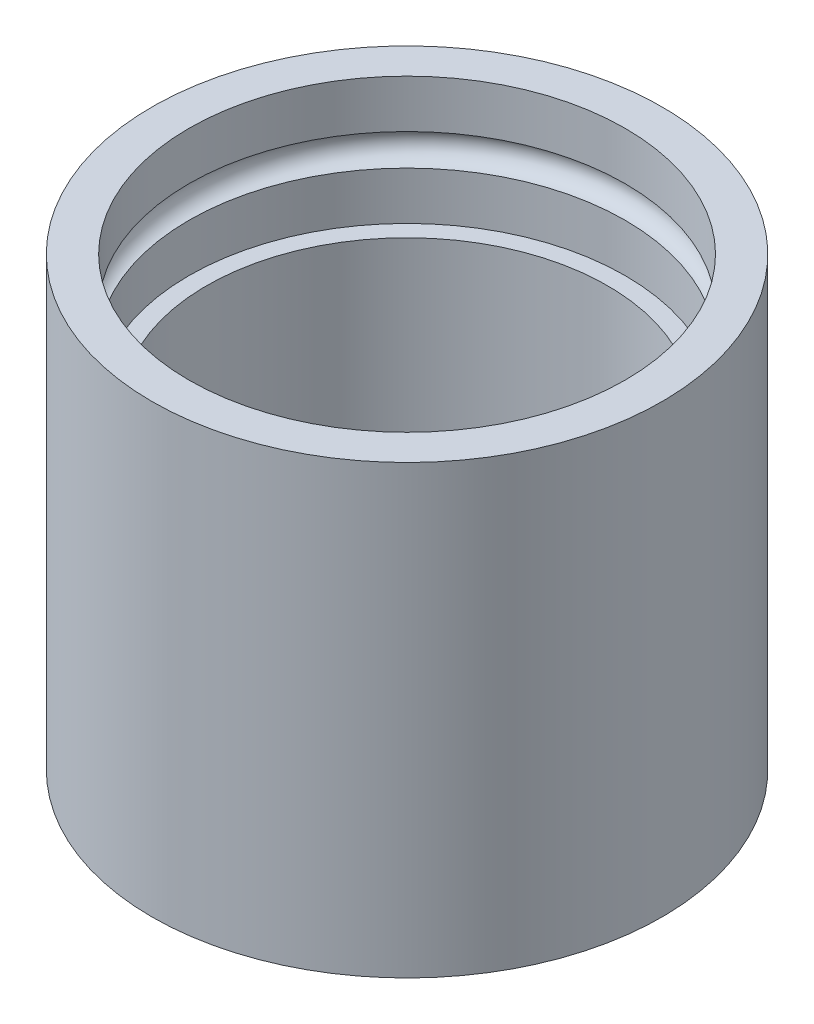
ISO-10303-21;
HEADER;
FILE_DESCRIPTION(('STEP AP214'),'2;1');
FILE_NAME('part.step','',(''),(''),'','','');
FILE_SCHEMA(('AUTOMOTIVE_DESIGN { 1 0 10303 214 1 1 1 1 }'));
ENDSEC;
DATA;
#1=APPLICATION_CONTEXT('core data for automotive mechanical design processes');
#2=APPLICATION_PROTOCOL_DEFINITION('international standard','automotive_design',2000,#1);
#3=PRODUCT_CONTEXT('',#1,'mechanical');
#4=PRODUCT('Part','Part','',(#3));
#5=PRODUCT_RELATED_PRODUCT_CATEGORY('part','',(#4));
#6=PRODUCT_DEFINITION_FORMATION('','',#4);
#7=PRODUCT_DEFINITION_CONTEXT('part definition',#1,'design');
#8=PRODUCT_DEFINITION('design','',#6,#7);
#9=PRODUCT_DEFINITION_SHAPE('','',#8);
#10=(LENGTH_UNIT() NAMED_UNIT(*) SI_UNIT(.MILLI.,.METRE.));
#11=(NAMED_UNIT(*) PLANE_ANGLE_UNIT() SI_UNIT($,.RADIAN.));
#12=(NAMED_UNIT(*) SI_UNIT($,.STERADIAN.) SOLID_ANGLE_UNIT());
#13=UNCERTAINTY_MEASURE_WITH_UNIT(LENGTH_MEASURE(1.E-05),#10,'distance_accuracy_value','');
#14=(GEOMETRIC_REPRESENTATION_CONTEXT(3) GLOBAL_UNCERTAINTY_ASSIGNED_CONTEXT((#13)) GLOBAL_UNIT_ASSIGNED_CONTEXT((#10,
#11,#12)) REPRESENTATION_CONTEXT('',''));
#15=CARTESIAN_POINT('',(0.,0.,0.));
#16=DIRECTION('',(0.,0.,1.));
#17=DIRECTION('',(1.,0.,0.));
#18=AXIS2_PLACEMENT_3D('',#15,#16,#17);
#19=CARTESIAN_POINT('',(0.,0.,-7.366));
#20=DIRECTION('',(0.,1.,0.));
#21=DIRECTION('',(0.,0.,1.));
#22=AXIS2_PLACEMENT_3D('',#19,#20,#21);
#23=PLANE('',#22);
#24=CARTESIAN_POINT('',(0.,0.,-50.8));
#25=DIRECTION('',(0.,1.,0.));
#26=DIRECTION('',(0.,0.,1.));
#27=AXIS2_PLACEMENT_3D('',#24,#25,#26);
#28=CIRCLE('',#27,50.8);
#29=CARTESIAN_POINT('',(0.,0.,0.));
#30=VERTEX_POINT('',#29);
#31=EDGE_CURVE('E67',#30,#30,#28,.T.);
#32=ORIENTED_EDGE('',*,*,#31,.T.);
#33=EDGE_LOOP('',(#32));
#34=FACE_BOUND('',#33,.T.);
#35=CARTESIAN_POINT('',(0.,0.,-50.8));
#36=DIRECTION('',(0.,1.,0.));
#37=DIRECTION('',(0.,0.,1.));
#38=AXIS2_PLACEMENT_3D('',#35,#36,#37);
#39=CIRCLE('',#38,43.434);
#40=CARTESIAN_POINT('',(0.,0.,-7.366));
#41=VERTEX_POINT('',#40);
#42=EDGE_CURVE('E10',#41,#41,#39,.T.);
#43=ORIENTED_EDGE('',*,*,#42,.F.);
#44=EDGE_LOOP('',(#43));
#45=FACE_BOUND('',#44,.T.);
#46=ADVANCED_FACE('F33',(#34,#45),#23,.T.);
#47=CARTESIAN_POINT('',(0.,-28.313229253638,-50.8));
#48=DIRECTION('',(0.,1.,0.));
#49=DIRECTION('',(0.,0.,1.));
#50=AXIS2_PLACEMENT_3D('',#47,#48,#49);
#51=CYLINDRICAL_SURFACE('',#50,43.434);
#52=ORIENTED_EDGE('',*,*,#42,.T.);
#53=EDGE_LOOP('',(#52));
#54=FACE_BOUND('',#53,.T.);
#55=CARTESIAN_POINT('',(0.,-9.55027561354662,-50.8));
#56=DIRECTION('',(0.,1.,0.));
#57=DIRECTION('',(0.,0.,1.));
#58=AXIS2_PLACEMENT_3D('',#55,#56,#57);
#59=CIRCLE('',#58,43.434);
#60=CARTESIAN_POINT('',(0.,-9.55027561354664,-7.366));
#61=VERTEX_POINT('',#60);
#62=EDGE_CURVE('E39',#61,#61,#59,.T.);
#63=ORIENTED_EDGE('',*,*,#62,.F.);
#64=EDGE_LOOP('',(#63));
#65=FACE_BOUND('',#64,.T.);
#66=ADVANCED_FACE('F85',(#54,#65),#51,.F.);
#67=CARTESIAN_POINT('',(0.,-12.7038418662199,-50.8));
#68=DIRECTION('',(0.,1.,0.));
#69=DIRECTION('',(0.,0.,1.));
#70=AXIS2_PLACEMENT_3D('',#67,#68,#69);
#71=TOROIDAL_SURFACE('',#70,43.0657,3.175);
#72=ORIENTED_EDGE('',*,*,#62,.T.);
#73=EDGE_LOOP('',(#72));
#74=FACE_BOUND('',#73,.T.);
#75=CARTESIAN_POINT('',(0.,-15.8574081188933,-50.8));
#76=DIRECTION('',(0.,1.,0.));
#77=DIRECTION('',(0.,0.,1.));
#78=AXIS2_PLACEMENT_3D('',#75,#76,#77);
#79=CIRCLE('',#78,43.434);
#80=CARTESIAN_POINT('',(0.,-15.8574081188933,-7.36599999999999));
#81=VERTEX_POINT('',#80);
#82=EDGE_CURVE('E43',#81,#81,#79,.T.);
#83=ORIENTED_EDGE('',*,*,#82,.F.);
#84=EDGE_LOOP('',(#83));
#85=FACE_BOUND('',#84,.T.);
#86=ADVANCED_FACE('F89',(#74,#85),#71,.F.);
#87=CARTESIAN_POINT('',(0.,-28.313229253638,-50.8));
#88=DIRECTION('',(0.,1.,0.));
#89=DIRECTION('',(0.,0.,1.));
#90=AXIS2_PLACEMENT_3D('',#87,#88,#89);
#91=CYLINDRICAL_SURFACE('',#90,43.434);
#92=ORIENTED_EDGE('',*,*,#82,.T.);
#93=EDGE_LOOP('',(#92));
#94=FACE_BOUND('',#93,.T.);
#95=CARTESIAN_POINT('',(0.,-25.4038418662199,-50.8));
#96=DIRECTION('',(0.,1.,0.));
#97=DIRECTION('',(0.,0.,1.));
#98=AXIS2_PLACEMENT_3D('',#95,#96,#97);
#99=CIRCLE('',#98,43.434);
#100=CARTESIAN_POINT('',(0.,-25.40384186622,-7.366));
#101=VERTEX_POINT('',#100);
#102=EDGE_CURVE('E47',#101,#101,#99,.T.);
#103=ORIENTED_EDGE('',*,*,#102,.F.);
#104=EDGE_LOOP('',(#103));
#105=FACE_BOUND('',#104,.T.);
#106=ADVANCED_FACE('F93',(#94,#105),#91,.F.);
#107=CARTESIAN_POINT('',(0.,-25.40384186622,-10.8585));
#108=DIRECTION('',(0.,1.,0.));
#109=DIRECTION('',(0.,0.,1.));
#110=AXIS2_PLACEMENT_3D('',#107,#108,#109);
#111=PLANE('',#110);
#112=ORIENTED_EDGE('',*,*,#102,.T.);
#113=EDGE_LOOP('',(#112));
#114=FACE_BOUND('',#113,.T.);
#115=CARTESIAN_POINT('',(0.,-25.4038418662199,-50.8));
#116=DIRECTION('',(0.,1.,0.));
#117=DIRECTION('',(0.,0.,1.));
#118=AXIS2_PLACEMENT_3D('',#115,#116,#117);
#119=CIRCLE('',#118,39.9415);
#120=CARTESIAN_POINT('',(0.,-25.40384186622,-10.8585));
#121=VERTEX_POINT('',#120);
#122=EDGE_CURVE('E52',#121,#121,#119,.T.);
#123=ORIENTED_EDGE('',*,*,#122,.F.);
#124=EDGE_LOOP('',(#123));
#125=FACE_BOUND('',#124,.T.);
#126=ADVANCED_FACE('F99',(#114,#125),#111,.T.);
#127=CARTESIAN_POINT('',(0.,-28.313229253638,-50.8));
#128=DIRECTION('',(0.,1.,0.));
#129=DIRECTION('',(0.,0.,1.));
#130=AXIS2_PLACEMENT_3D('',#127,#128,#129);
#131=CYLINDRICAL_SURFACE('',#130,39.9415);
#132=ORIENTED_EDGE('',*,*,#122,.T.);
#133=EDGE_LOOP('',(#132));
#134=FACE_BOUND('',#133,.T.);
#135=CARTESIAN_POINT('',(0.,-76.2,-50.8));
#136=DIRECTION('',(0.,1.,0.));
#137=DIRECTION('',(0.,0.,1.));
#138=AXIS2_PLACEMENT_3D('',#135,#136,#137);
#139=CIRCLE('',#138,39.9415);
#140=CARTESIAN_POINT('',(0.,-76.2,-10.8585));
#141=VERTEX_POINT('',#140);
#142=EDGE_CURVE('E55',#141,#141,#139,.T.);
#143=ORIENTED_EDGE('',*,*,#142,.F.);
#144=EDGE_LOOP('',(#143));
#145=FACE_BOUND('',#144,.T.);
#146=ADVANCED_FACE('F103',(#134,#145),#131,.F.);
#147=CARTESIAN_POINT('',(0.,-76.2,-10.8585));
#148=DIRECTION('',(0.,1.,0.));
#149=DIRECTION('',(0.,0.,1.));
#150=AXIS2_PLACEMENT_3D('',#147,#148,#149);
#151=PLANE('',#150);
#152=ORIENTED_EDGE('',*,*,#142,.T.);
#153=EDGE_LOOP('',(#152));
#154=FACE_BOUND('',#153,.T.);
#155=CARTESIAN_POINT('',(0.,-76.2,-50.8));
#156=DIRECTION('',(0.,1.,0.));
#157=DIRECTION('',(0.,0.,1.));
#158=AXIS2_PLACEMENT_3D('',#155,#156,#157);
#159=CIRCLE('',#158,32.3215);
#160=CARTESIAN_POINT('',(0.,-76.2,-18.4785));
#161=VERTEX_POINT('',#160);
#162=EDGE_CURVE('E58',#161,#161,#159,.T.);
#163=ORIENTED_EDGE('',*,*,#162,.F.);
#164=EDGE_LOOP('',(#163));
#165=FACE_BOUND('',#164,.T.);
#166=ADVANCED_FACE('F107',(#154,#165),#151,.T.);
#167=CARTESIAN_POINT('',(0.,-28.313229253638,-50.8));
#168=DIRECTION('',(0.,1.,0.));
#169=DIRECTION('',(0.,0.,1.));
#170=AXIS2_PLACEMENT_3D('',#167,#168,#169);
#171=CYLINDRICAL_SURFACE('',#170,32.3215);
#172=ORIENTED_EDGE('',*,*,#162,.T.);
#173=EDGE_LOOP('',(#172));
#174=FACE_BOUND('',#173,.T.);
#175=CARTESIAN_POINT('',(0.,-88.9,-50.8));
#176=DIRECTION('',(0.,1.,0.));
#177=DIRECTION('',(0.,0.,1.));
#178=AXIS2_PLACEMENT_3D('',#175,#176,#177);
#179=CIRCLE('',#178,32.3215);
#180=CARTESIAN_POINT('',(0.,-88.9,-18.4785));
#181=VERTEX_POINT('',#180);
#182=EDGE_CURVE('E61',#181,#181,#179,.T.);
#183=ORIENTED_EDGE('',*,*,#182,.F.);
#184=EDGE_LOOP('',(#183));
#185=FACE_BOUND('',#184,.T.);
#186=ADVANCED_FACE('F81',(#174,#185),#171,.F.);
#187=CARTESIAN_POINT('',(0.,-88.9,0.));
#188=DIRECTION('',(0.,-1.,0.));
#189=DIRECTION('',(0.,0.,-1.));
#190=AXIS2_PLACEMENT_3D('',#187,#188,#189);
#191=PLANE('',#190);
#192=ORIENTED_EDGE('',*,*,#182,.T.);
#193=EDGE_LOOP('',(#192));
#194=FACE_BOUND('',#193,.T.);
#195=CARTESIAN_POINT('',(0.,-88.9,-50.8));
#196=DIRECTION('',(0.,1.,0.));
#197=DIRECTION('',(0.,0.,1.));
#198=AXIS2_PLACEMENT_3D('',#195,#196,#197);
#199=CIRCLE('',#198,50.8);
#200=CARTESIAN_POINT('',(0.,-88.9,0.));
#201=VERTEX_POINT('',#200);
#202=EDGE_CURVE('E64',#201,#201,#199,.T.);
#203=ORIENTED_EDGE('',*,*,#202,.F.);
#204=EDGE_LOOP('',(#203));
#205=FACE_BOUND('',#204,.T.);
#206=ADVANCED_FACE('F75',(#194,#205),#191,.T.);
#207=CARTESIAN_POINT('',(0.,-28.313229253638,-50.8));
#208=DIRECTION('',(0.,1.,0.));
#209=DIRECTION('',(0.,0.,1.));
#210=AXIS2_PLACEMENT_3D('',#207,#208,#209);
#211=CYLINDRICAL_SURFACE('',#210,50.8);
#212=ORIENTED_EDGE('',*,*,#202,.T.);
#213=EDGE_LOOP('',(#212));
#214=FACE_BOUND('',#213,.T.);
#215=ORIENTED_EDGE('',*,*,#31,.F.);
#216=EDGE_LOOP('',(#215));
#217=FACE_BOUND('',#216,.T.);
#218=ADVANCED_FACE('F73',(#214,#217),#211,.T.);
#219=CLOSED_SHELL('',(#46,#66,#86,#106,#126,#146,#166,#186,#206,#218));
#220=MANIFOLD_SOLID_BREP('B2',#219);
#221=ADVANCED_BREP_SHAPE_REPRESENTATION('',(#18,#220),#14);
#222=SHAPE_DEFINITION_REPRESENTATION(#9,#221);
ENDSEC;
END-ISO-10303-21;
